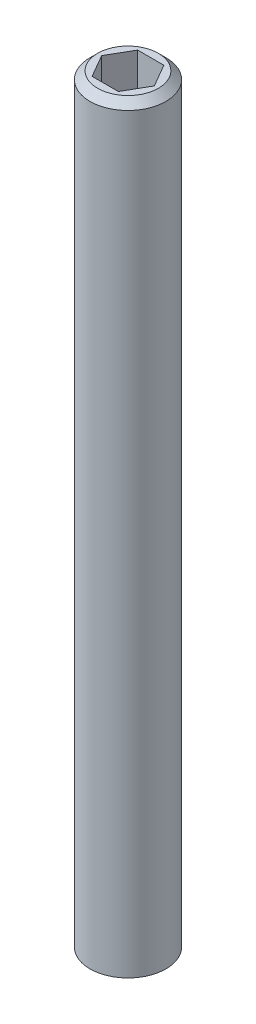
ISO-10303-21;
HEADER;
FILE_DESCRIPTION(('STEP AP214'),'2;1');
FILE_NAME('part.step','',(''),(''),'','','');
FILE_SCHEMA(('AUTOMOTIVE_DESIGN { 1 0 10303 214 1 1 1 1 }'));
ENDSEC;
DATA;
#1=APPLICATION_CONTEXT('core data for automotive mechanical design processes');
#2=APPLICATION_PROTOCOL_DEFINITION('international standard','automotive_design',2000,#1);
#3=PRODUCT_CONTEXT('',#1,'mechanical');
#4=PRODUCT('Part','Part','',(#3));
#5=PRODUCT_RELATED_PRODUCT_CATEGORY('part','',(#4));
#6=PRODUCT_DEFINITION_FORMATION('','',#4);
#7=PRODUCT_DEFINITION_CONTEXT('part definition',#1,'design');
#8=PRODUCT_DEFINITION('design','',#6,#7);
#9=PRODUCT_DEFINITION_SHAPE('','',#8);
#10=(LENGTH_UNIT() NAMED_UNIT(*) SI_UNIT(.MILLI.,.METRE.));
#11=(NAMED_UNIT(*) PLANE_ANGLE_UNIT() SI_UNIT($,.RADIAN.));
#12=(NAMED_UNIT(*) SI_UNIT($,.STERADIAN.) SOLID_ANGLE_UNIT());
#13=UNCERTAINTY_MEASURE_WITH_UNIT(LENGTH_MEASURE(1.E-05),#10,'distance_accuracy_value','');
#14=(GEOMETRIC_REPRESENTATION_CONTEXT(3) GLOBAL_UNCERTAINTY_ASSIGNED_CONTEXT((#13)) GLOBAL_UNIT_ASSIGNED_CONTEXT((#10,
#11,#12)) REPRESENTATION_CONTEXT('',''));
#15=CARTESIAN_POINT('',(0.,0.,0.));
#16=DIRECTION('',(0.,0.,1.));
#17=DIRECTION('',(1.,0.,0.));
#18=AXIS2_PLACEMENT_3D('',#15,#16,#17);
#19=CARTESIAN_POINT('',(0.,25.,0.));
#20=DIRECTION('',(0.,-1.,0.));
#21=DIRECTION('',(0.,0.,-1.));
#22=AXIS2_PLACEMENT_3D('',#19,#20,#21);
#23=CYLINDRICAL_SURFACE('',#22,1.25);
#24=CARTESIAN_POINT('',(0.,24.75,0.));
#25=DIRECTION('',(0.,1.,0.));
#26=DIRECTION('',(0.,0.,1.));
#27=AXIS2_PLACEMENT_3D('',#24,#25,#26);
#28=CIRCLE('',#27,1.25);
#29=CARTESIAN_POINT('',(0.,24.75,1.25));
#30=VERTEX_POINT('',#29);
#31=EDGE_CURVE('E11',#30,#30,#28,.F.);
#32=ORIENTED_EDGE('',*,*,#31,.T.);
#33=EDGE_LOOP('',(#32));
#34=FACE_BOUND('',#33,.T.);
#35=CARTESIAN_POINT('',(0.,0.,0.));
#36=DIRECTION('',(0.,1.,0.));
#37=DIRECTION('',(0.,0.,1.));
#38=AXIS2_PLACEMENT_3D('',#35,#36,#37);
#39=CIRCLE('',#38,1.25);
#40=CARTESIAN_POINT('',(0.,0.,1.25));
#41=VERTEX_POINT('',#40);
#42=EDGE_CURVE('E136',#41,#41,#39,.T.);
#43=ORIENTED_EDGE('',*,*,#42,.T.);
#44=EDGE_LOOP('',(#43));
#45=FACE_BOUND('',#44,.T.);
#46=ADVANCED_FACE('F34',(#34,#45),#23,.T.);
#47=CARTESIAN_POINT('',(0.,25.,0.));
#48=DIRECTION('',(0.,1.,0.));
#49=DIRECTION('',(0.,0.,1.));
#50=AXIS2_PLACEMENT_3D('',#47,#48,#49);
#51=PLANE('',#50);
#52=CARTESIAN_POINT('',(0.,25.,0.));
#53=DIRECTION('',(0.,1.,0.));
#54=DIRECTION('',(0.,0.,1.));
#55=AXIS2_PLACEMENT_3D('',#52,#53,#54);
#56=CIRCLE('',#55,1.);
#57=CARTESIAN_POINT('',(0.,25.,1.));
#58=VERTEX_POINT('',#57);
#59=EDGE_CURVE('E42',#58,#58,#56,.T.);
#60=ORIENTED_EDGE('',*,*,#59,.T.);
#61=EDGE_LOOP('',(#60));
#62=FACE_BOUND('',#61,.T.);
#63=DIRECTION('',(0.5,0.,-0.866025403784439));
#64=VECTOR('',#63,1.);
#65=CARTESIAN_POINT('',(0.43301270189222,25.,0.75));
#66=LINE('',#65,#64);
#67=CARTESIAN_POINT('',(0.43301270189222,25.,0.75));
#68=VERTEX_POINT('',#67);
#69=CARTESIAN_POINT('',(0.866025403784439,25.,0.));
#70=VERTEX_POINT('',#69);
#71=EDGE_CURVE('E49',#68,#70,#66,.T.);
#72=ORIENTED_EDGE('',*,*,#71,.F.);
#73=DIRECTION('',(1.,0.,0.));
#74=VECTOR('',#73,1.);
#75=CARTESIAN_POINT('',(-0.433012701892219,25.,0.75));
#76=LINE('',#75,#74);
#77=CARTESIAN_POINT('',(-0.433012701892219,25.,0.75));
#78=VERTEX_POINT('',#77);
#79=EDGE_CURVE('E132',#78,#68,#76,.T.);
#80=ORIENTED_EDGE('',*,*,#79,.F.);
#81=DIRECTION('',(0.5,0.,0.866025403784439));
#82=VECTOR('',#81,1.);
#83=CARTESIAN_POINT('',(-0.866025403784439,25.,0.));
#84=LINE('',#83,#82);
#85=CARTESIAN_POINT('',(-0.866025403784439,25.,0.));
#86=VERTEX_POINT('',#85);
#87=EDGE_CURVE('E130',#86,#78,#84,.T.);
#88=ORIENTED_EDGE('',*,*,#87,.F.);
#89=DIRECTION('',(-0.5,0.,0.866025403784439));
#90=VECTOR('',#89,1.);
#91=CARTESIAN_POINT('',(-0.43301270189222,25.,-0.75));
#92=LINE('',#91,#90);
#93=CARTESIAN_POINT('',(-0.43301270189222,25.,-0.75));
#94=VERTEX_POINT('',#93);
#95=EDGE_CURVE('E97',#94,#86,#92,.T.);
#96=ORIENTED_EDGE('',*,*,#95,.F.);
#97=DIRECTION('',(-1.,0.,0.));
#98=VECTOR('',#97,1.);
#99=CARTESIAN_POINT('',(0.433012701892219,25.,-0.75));
#100=LINE('',#99,#98);
#101=CARTESIAN_POINT('',(0.433012701892219,25.,-0.75));
#102=VERTEX_POINT('',#101);
#103=EDGE_CURVE('E126',#102,#94,#100,.T.);
#104=ORIENTED_EDGE('',*,*,#103,.F.);
#105=DIRECTION('',(-0.5,0.,-0.866025403784438));
#106=VECTOR('',#105,1.);
#107=CARTESIAN_POINT('',(0.866025403784439,25.,0.));
#108=LINE('',#107,#106);
#109=EDGE_CURVE('E123',#70,#102,#108,.T.);
#110=ORIENTED_EDGE('',*,*,#109,.F.);
#111=EDGE_LOOP('',(#72,#80,#88,#96,#104,#110));
#112=FACE_BOUND('',#111,.T.);
#113=ADVANCED_FACE('F146',(#62,#112),#51,.T.);
#114=CARTESIAN_POINT('',(0.,0.,0.));
#115=DIRECTION('',(0.,1.,0.));
#116=DIRECTION('',(0.,0.,1.));
#117=AXIS2_PLACEMENT_3D('',#114,#115,#116);
#118=PLANE('',#117);
#119=ORIENTED_EDGE('',*,*,#42,.F.);
#120=EDGE_LOOP('',(#119));
#121=FACE_BOUND('',#120,.T.);
#122=ADVANCED_FACE('F162',(#121),#118,.F.);
#123=CARTESIAN_POINT('',(0.43301270189222,23.,0.75));
#124=DIRECTION('',(0.866025403784439,0.,0.499999999999999));
#125=DIRECTION('',(0.5,0.,-0.866025403784439));
#126=AXIS2_PLACEMENT_3D('',#123,#124,#125);
#127=PLANE('',#126);
#128=ORIENTED_EDGE('',*,*,#71,.T.);
#129=DIRECTION('',(0.,1.,0.));
#130=VECTOR('',#129,1.);
#131=CARTESIAN_POINT('',(0.866025403784439,23.,0.));
#132=LINE('',#131,#130);
#133=CARTESIAN_POINT('',(0.866025403784439,23.,0.));
#134=VERTEX_POINT('',#133);
#135=EDGE_CURVE('E79',#134,#70,#132,.T.);
#136=ORIENTED_EDGE('',*,*,#135,.F.);
#137=DIRECTION('',(0.5,0.,-0.866025403784439));
#138=VECTOR('',#137,1.);
#139=CARTESIAN_POINT('',(0.43301270189222,23.,0.75));
#140=LINE('',#139,#138);
#141=CARTESIAN_POINT('',(0.43301270189222,23.,0.75));
#142=VERTEX_POINT('',#141);
#143=EDGE_CURVE('E134',#142,#134,#140,.T.);
#144=ORIENTED_EDGE('',*,*,#143,.F.);
#145=DIRECTION('',(0.,1.,0.));
#146=VECTOR('',#145,1.);
#147=CARTESIAN_POINT('',(0.43301270189222,23.,0.75));
#148=LINE('',#147,#146);
#149=EDGE_CURVE('E57',#142,#68,#148,.T.);
#150=ORIENTED_EDGE('',*,*,#149,.T.);
#151=EDGE_LOOP('',(#128,#136,#144,#150));
#152=FACE_BOUND('',#151,.T.);
#153=ADVANCED_FACE('F167',(#152),#127,.F.);
#154=CARTESIAN_POINT('',(-0.433012701892219,23.,0.75));
#155=DIRECTION('',(0.,0.,1.));
#156=DIRECTION('',(1.,0.,0.));
#157=AXIS2_PLACEMENT_3D('',#154,#155,#156);
#158=PLANE('',#157);
#159=ORIENTED_EDGE('',*,*,#79,.T.);
#160=ORIENTED_EDGE('',*,*,#149,.F.);
#161=DIRECTION('',(1.,0.,0.));
#162=VECTOR('',#161,1.);
#163=CARTESIAN_POINT('',(-0.433012701892219,23.,0.75));
#164=LINE('',#163,#162);
#165=CARTESIAN_POINT('',(-0.433012701892219,23.,0.75));
#166=VERTEX_POINT('',#165);
#167=EDGE_CURVE('E109',#166,#142,#164,.T.);
#168=ORIENTED_EDGE('',*,*,#167,.F.);
#169=DIRECTION('',(0.,1.,0.));
#170=VECTOR('',#169,1.);
#171=CARTESIAN_POINT('',(-0.433012701892219,23.,0.75));
#172=LINE('',#171,#170);
#173=EDGE_CURVE('E101',#166,#78,#172,.T.);
#174=ORIENTED_EDGE('',*,*,#173,.T.);
#175=EDGE_LOOP('',(#159,#160,#168,#174));
#176=FACE_BOUND('',#175,.T.);
#177=ADVANCED_FACE('F172',(#176),#158,.F.);
#178=CARTESIAN_POINT('',(-0.866025403784439,23.,0.));
#179=DIRECTION('',(-0.866025403784439,0.,0.5));
#180=DIRECTION('',(0.5,0.,0.866025403784439));
#181=AXIS2_PLACEMENT_3D('',#178,#179,#180);
#182=PLANE('',#181);
#183=ORIENTED_EDGE('',*,*,#87,.T.);
#184=ORIENTED_EDGE('',*,*,#173,.F.);
#185=DIRECTION('',(0.5,0.,0.866025403784439));
#186=VECTOR('',#185,1.);
#187=CARTESIAN_POINT('',(-0.866025403784439,23.,0.));
#188=LINE('',#187,#186);
#189=CARTESIAN_POINT('',(-0.866025403784439,23.,0.));
#190=VERTEX_POINT('',#189);
#191=EDGE_CURVE('E105',#190,#166,#188,.T.);
#192=ORIENTED_EDGE('',*,*,#191,.F.);
#193=DIRECTION('',(0.,1.,0.));
#194=VECTOR('',#193,1.);
#195=CARTESIAN_POINT('',(-0.866025403784439,23.,0.));
#196=LINE('',#195,#194);
#197=EDGE_CURVE('E90',#190,#86,#196,.T.);
#198=ORIENTED_EDGE('',*,*,#197,.T.);
#199=EDGE_LOOP('',(#183,#184,#192,#198));
#200=FACE_BOUND('',#199,.T.);
#201=ADVANCED_FACE('F106',(#200),#182,.F.);
#202=CARTESIAN_POINT('',(-0.43301270189222,23.,-0.75));
#203=DIRECTION('',(-0.866025403784439,0.,-0.5));
#204=DIRECTION('',(-0.5,0.,0.866025403784439));
#205=AXIS2_PLACEMENT_3D('',#202,#203,#204);
#206=PLANE('',#205);
#207=ORIENTED_EDGE('',*,*,#95,.T.);
#208=ORIENTED_EDGE('',*,*,#197,.F.);
#209=DIRECTION('',(-0.5,0.,0.866025403784439));
#210=VECTOR('',#209,1.);
#211=CARTESIAN_POINT('',(-0.43301270189222,23.,-0.75));
#212=LINE('',#211,#210);
#213=CARTESIAN_POINT('',(-0.43301270189222,23.,-0.75));
#214=VERTEX_POINT('',#213);
#215=EDGE_CURVE('E94',#214,#190,#212,.T.);
#216=ORIENTED_EDGE('',*,*,#215,.F.);
#217=DIRECTION('',(0.,1.,0.));
#218=VECTOR('',#217,1.);
#219=CARTESIAN_POINT('',(-0.43301270189222,23.,-0.75));
#220=LINE('',#219,#218);
#221=EDGE_CURVE('E102',#214,#94,#220,.T.);
#222=ORIENTED_EDGE('',*,*,#221,.T.);
#223=EDGE_LOOP('',(#207,#208,#216,#222));
#224=FACE_BOUND('',#223,.T.);
#225=ADVANCED_FACE('F92',(#224),#206,.F.);
#226=CARTESIAN_POINT('',(0.433012701892219,23.,-0.75));
#227=DIRECTION('',(0.,0.,-1.));
#228=DIRECTION('',(-1.,0.,0.));
#229=AXIS2_PLACEMENT_3D('',#226,#227,#228);
#230=PLANE('',#229);
#231=ORIENTED_EDGE('',*,*,#103,.T.);
#232=ORIENTED_EDGE('',*,*,#221,.F.);
#233=DIRECTION('',(-1.,0.,0.));
#234=VECTOR('',#233,1.);
#235=CARTESIAN_POINT('',(0.433012701892219,23.,-0.75));
#236=LINE('',#235,#234);
#237=CARTESIAN_POINT('',(0.433012701892219,23.,-0.75));
#238=VERTEX_POINT('',#237);
#239=EDGE_CURVE('E115',#238,#214,#236,.T.);
#240=ORIENTED_EDGE('',*,*,#239,.F.);
#241=DIRECTION('',(0.,1.,0.));
#242=VECTOR('',#241,1.);
#243=CARTESIAN_POINT('',(0.433012701892219,23.,-0.75));
#244=LINE('',#243,#242);
#245=EDGE_CURVE('E139',#238,#102,#244,.T.);
#246=ORIENTED_EDGE('',*,*,#245,.T.);
#247=EDGE_LOOP('',(#231,#232,#240,#246));
#248=FACE_BOUND('',#247,.T.);
#249=ADVANCED_FACE('F175',(#248),#230,.F.);
#250=CARTESIAN_POINT('',(0.866025403784439,23.,0.));
#251=DIRECTION('',(0.866025403784438,0.,-0.5));
#252=DIRECTION('',(-0.5,0.,-0.866025403784439));
#253=AXIS2_PLACEMENT_3D('',#250,#251,#252);
#254=PLANE('',#253);
#255=ORIENTED_EDGE('',*,*,#109,.T.);
#256=ORIENTED_EDGE('',*,*,#245,.F.);
#257=DIRECTION('',(-0.5,0.,-0.866025403784438));
#258=VECTOR('',#257,1.);
#259=CARTESIAN_POINT('',(0.866025403784439,23.,0.));
#260=LINE('',#259,#258);
#261=EDGE_CURVE('E117',#134,#238,#260,.T.);
#262=ORIENTED_EDGE('',*,*,#261,.F.);
#263=ORIENTED_EDGE('',*,*,#135,.T.);
#264=EDGE_LOOP('',(#255,#256,#262,#263));
#265=FACE_BOUND('',#264,.T.);
#266=ADVANCED_FACE('F154',(#265),#254,.F.);
#267=CARTESIAN_POINT('',(0.,23.,0.));
#268=DIRECTION('',(0.,1.,0.));
#269=DIRECTION('',(0.,0.,1.));
#270=AXIS2_PLACEMENT_3D('',#267,#268,#269);
#271=PLANE('',#270);
#272=ORIENTED_EDGE('',*,*,#143,.T.);
#273=ORIENTED_EDGE('',*,*,#261,.T.);
#274=ORIENTED_EDGE('',*,*,#239,.T.);
#275=ORIENTED_EDGE('',*,*,#215,.T.);
#276=ORIENTED_EDGE('',*,*,#191,.T.);
#277=ORIENTED_EDGE('',*,*,#167,.T.);
#278=EDGE_LOOP('',(#272,#273,#274,#275,#276,#277));
#279=FACE_BOUND('',#278,.T.);
#280=ADVANCED_FACE('F112',(#279),#271,.T.);
#281=CARTESIAN_POINT('',(0.,25.,0.));
#282=DIRECTION('',(0.,-1.,0.));
#283=DIRECTION('',(0.,0.,-1.));
#284=AXIS2_PLACEMENT_3D('',#281,#282,#283);
#285=CONICAL_SURFACE('',#284,1.,0.785398163397446);
#286=ORIENTED_EDGE('',*,*,#31,.F.);
#287=EDGE_LOOP('',(#286));
#288=FACE_BOUND('',#287,.T.);
#289=ORIENTED_EDGE('',*,*,#59,.F.);
#290=EDGE_LOOP('',(#289));
#291=FACE_BOUND('',#290,.T.);
#292=ADVANCED_FACE('F36',(#288,#291),#285,.T.);
#293=CLOSED_SHELL('',(#46,#113,#122,#153,#177,#201,#225,#249,#266,#280,#292));
#294=MANIFOLD_SOLID_BREP('B2',#293);
#295=ADVANCED_BREP_SHAPE_REPRESENTATION('',(#18,#294),#14);
#296=SHAPE_DEFINITION_REPRESENTATION(#9,#295);
ENDSEC;
END-ISO-10303-21;
